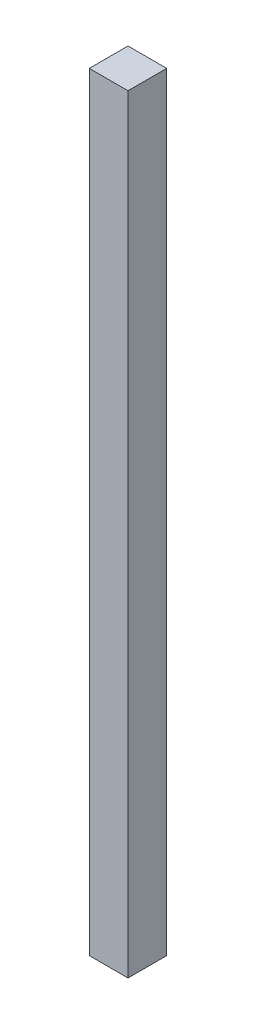
ISO-10303-21;
HEADER;
FILE_DESCRIPTION(('STEP AP214'),'2;1');
FILE_NAME('part.step','',(''),(''),'','','');
FILE_SCHEMA(('AUTOMOTIVE_DESIGN { 1 0 10303 214 1 1 1 1 }'));
ENDSEC;
DATA;
#1=APPLICATION_CONTEXT('core data for automotive mechanical design processes');
#2=APPLICATION_PROTOCOL_DEFINITION('international standard','automotive_design',2000,#1);
#3=PRODUCT_CONTEXT('',#1,'mechanical');
#4=PRODUCT('Part','Part','',(#3));
#5=PRODUCT_RELATED_PRODUCT_CATEGORY('part','',(#4));
#6=PRODUCT_DEFINITION_FORMATION('','',#4);
#7=PRODUCT_DEFINITION_CONTEXT('part definition',#1,'design');
#8=PRODUCT_DEFINITION('design','',#6,#7);
#9=PRODUCT_DEFINITION_SHAPE('','',#8);
#10=(LENGTH_UNIT() NAMED_UNIT(*) SI_UNIT(.MILLI.,.METRE.));
#11=(NAMED_UNIT(*) PLANE_ANGLE_UNIT() SI_UNIT($,.RADIAN.));
#12=(NAMED_UNIT(*) SI_UNIT($,.STERADIAN.) SOLID_ANGLE_UNIT());
#13=UNCERTAINTY_MEASURE_WITH_UNIT(LENGTH_MEASURE(1.E-05),#10,'distance_accuracy_value','');
#14=(GEOMETRIC_REPRESENTATION_CONTEXT(3) GLOBAL_UNCERTAINTY_ASSIGNED_CONTEXT((#13)) GLOBAL_UNIT_ASSIGNED_CONTEXT((#10,
#11,#12)) REPRESENTATION_CONTEXT('',''));
#15=CARTESIAN_POINT('',(0.,0.,0.));
#16=DIRECTION('',(0.,0.,1.));
#17=DIRECTION('',(1.,0.,0.));
#18=AXIS2_PLACEMENT_3D('',#15,#16,#17);
#19=CARTESIAN_POINT('',(-7.7715611723761E-13,503.682,2.66453525910038E-12));
#20=DIRECTION('',(1.,0.,0.));
#21=DIRECTION('',(0.,0.,-0.999999999999997));
#22=AXIS2_PLACEMENT_3D('',#19,#20,#21);
#23=PLANE('',#22);
#24=DIRECTION('',(0.,0.,0.999999999999997));
#25=VECTOR('',#24,1.);
#26=CARTESIAN_POINT('',(0.,0.,0.));
#27=LINE('',#26,#25);
#28=CARTESIAN_POINT('',(-5.55111512312578E-13,0.,-25.4000000000001));
#29=VERTEX_POINT('',#28);
#30=CARTESIAN_POINT('',(0.,0.,0.));
#31=VERTEX_POINT('',#30);
#32=EDGE_CURVE('E97',#29,#31,#27,.T.);
#33=ORIENTED_EDGE('',*,*,#32,.T.);
#34=DIRECTION('',(0.,-0.999999999999999,0.));
#35=VECTOR('',#34,1.);
#36=CARTESIAN_POINT('',(-7.7715611723761E-13,503.682,2.66453525910038E-12));
#37=LINE('',#36,#35);
#38=CARTESIAN_POINT('',(-7.7715611723761E-13,503.682,2.66453525910038E-12));
#39=VERTEX_POINT('',#38);
#40=EDGE_CURVE('E11',#39,#31,#37,.T.);
#41=ORIENTED_EDGE('',*,*,#40,.F.);
#42=DIRECTION('',(0.,0.,0.999999999999997));
#43=VECTOR('',#42,1.);
#44=CARTESIAN_POINT('',(-7.7715611723761E-13,503.682,2.66453525910038E-12));
#45=LINE('',#44,#43);
#46=CARTESIAN_POINT('',(-7.7715611723761E-13,503.682,-25.3999999999972));
#47=VERTEX_POINT('',#46);
#48=EDGE_CURVE('E85',#47,#39,#45,.T.);
#49=ORIENTED_EDGE('',*,*,#48,.F.);
#50=DIRECTION('',(0.,-0.999999999999999,0.));
#51=VECTOR('',#50,1.);
#52=CARTESIAN_POINT('',(-7.7715611723761E-13,503.682,-25.3999999999972));
#53=LINE('',#52,#51);
#54=EDGE_CURVE('E93',#47,#29,#53,.T.);
#55=ORIENTED_EDGE('',*,*,#54,.T.);
#56=EDGE_LOOP('',(#33,#41,#49,#55));
#57=FACE_BOUND('',#56,.T.);
#58=ADVANCED_FACE('F34',(#57),#23,.F.);
#59=CARTESIAN_POINT('',(-7.7715611723761E-13,503.682,2.66453525910038E-12));
#60=DIRECTION('',(0.,0.,-0.999999999999997));
#61=DIRECTION('',(-1.,0.,0.));
#62=AXIS2_PLACEMENT_3D('',#59,#60,#61);
#63=PLANE('',#62);
#64=DIRECTION('',(1.,0.,0.));
#65=VECTOR('',#64,1.);
#66=CARTESIAN_POINT('',(0.,0.,0.));
#67=LINE('',#66,#65);
#68=CARTESIAN_POINT('',(25.3999999999988,0.,0.));
#69=VERTEX_POINT('',#68);
#70=EDGE_CURVE('E89',#31,#69,#67,.T.);
#71=ORIENTED_EDGE('',*,*,#70,.T.);
#72=DIRECTION('',(0.,-0.999999999999999,0.));
#73=VECTOR('',#72,1.);
#74=CARTESIAN_POINT('',(25.3999999999994,503.682,2.66453525910038E-12));
#75=LINE('',#74,#73);
#76=CARTESIAN_POINT('',(25.3999999999994,503.682,2.66453525910038E-12));
#77=VERTEX_POINT('',#76);
#78=EDGE_CURVE('E42',#77,#69,#75,.T.);
#79=ORIENTED_EDGE('',*,*,#78,.F.);
#80=DIRECTION('',(1.,0.,0.));
#81=VECTOR('',#80,1.);
#82=CARTESIAN_POINT('',(-7.7715611723761E-13,503.682,2.66453525910038E-12));
#83=LINE('',#82,#81);
#84=EDGE_CURVE('E80',#39,#77,#83,.T.);
#85=ORIENTED_EDGE('',*,*,#84,.F.);
#86=ORIENTED_EDGE('',*,*,#40,.T.);
#87=EDGE_LOOP('',(#71,#79,#85,#86));
#88=FACE_BOUND('',#87,.T.);
#89=ADVANCED_FACE('F88',(#88),#63,.F.);
#90=CARTESIAN_POINT('',(25.3999999999994,503.682,2.66453525910038E-12));
#91=DIRECTION('',(-1.,0.,0.));
#92=DIRECTION('',(0.,0.,0.999999999999997));
#93=AXIS2_PLACEMENT_3D('',#90,#91,#92);
#94=PLANE('',#93);
#95=DIRECTION('',(0.,0.,-0.999999999999997));
#96=VECTOR('',#95,1.);
#97=CARTESIAN_POINT('',(25.3999999999988,0.,0.));
#98=LINE('',#97,#96);
#99=CARTESIAN_POINT('',(25.3999999999985,0.,-25.4000000000001));
#100=VERTEX_POINT('',#99);
#101=EDGE_CURVE('E67',#69,#100,#98,.T.);
#102=ORIENTED_EDGE('',*,*,#101,.T.);
#103=DIRECTION('',(0.,-0.999999999999999,0.));
#104=VECTOR('',#103,1.);
#105=CARTESIAN_POINT('',(25.3999999999994,503.682,-25.3999999999972));
#106=LINE('',#105,#104);
#107=CARTESIAN_POINT('',(25.3999999999994,503.682,-25.3999999999972));
#108=VERTEX_POINT('',#107);
#109=EDGE_CURVE('E90',#108,#100,#106,.T.);
#110=ORIENTED_EDGE('',*,*,#109,.F.);
#111=DIRECTION('',(0.,0.,-0.999999999999997));
#112=VECTOR('',#111,1.);
#113=CARTESIAN_POINT('',(25.3999999999994,503.682,2.66453525910038E-12));
#114=LINE('',#113,#112);
#115=EDGE_CURVE('E83',#77,#108,#114,.T.);
#116=ORIENTED_EDGE('',*,*,#115,.F.);
#117=ORIENTED_EDGE('',*,*,#78,.T.);
#118=EDGE_LOOP('',(#102,#110,#116,#117));
#119=FACE_BOUND('',#118,.T.);
#120=ADVANCED_FACE('F91',(#119),#94,.F.);
#121=CARTESIAN_POINT('',(-7.7715611723761E-13,503.682,-25.3999999999972));
#122=DIRECTION('',(0.,0.,0.999999999999997));
#123=DIRECTION('',(1.,0.,0.));
#124=AXIS2_PLACEMENT_3D('',#121,#122,#123);
#125=PLANE('',#124);
#126=DIRECTION('',(-1.,0.,0.));
#127=VECTOR('',#126,1.);
#128=CARTESIAN_POINT('',(-5.55111512312578E-13,0.,-25.4000000000001));
#129=LINE('',#128,#127);
#130=EDGE_CURVE('E73',#100,#29,#129,.T.);
#131=ORIENTED_EDGE('',*,*,#130,.T.);
#132=ORIENTED_EDGE('',*,*,#54,.F.);
#133=DIRECTION('',(-1.,0.,0.));
#134=VECTOR('',#133,1.);
#135=CARTESIAN_POINT('',(-7.7715611723761E-13,503.682,-25.3999999999972));
#136=LINE('',#135,#134);
#137=EDGE_CURVE('E50',#108,#47,#136,.T.);
#138=ORIENTED_EDGE('',*,*,#137,.F.);
#139=ORIENTED_EDGE('',*,*,#109,.T.);
#140=EDGE_LOOP('',(#131,#132,#138,#139));
#141=FACE_BOUND('',#140,.T.);
#142=ADVANCED_FACE('F104',(#141),#125,.F.);
#143=CARTESIAN_POINT('',(-7.7715611723761E-13,503.682,2.66453525910038E-12));
#144=DIRECTION('',(0.,-0.999999999999999,0.));
#145=DIRECTION('',(0.,0.,-0.999999999999997));
#146=AXIS2_PLACEMENT_3D('',#143,#144,#145);
#147=PLANE('',#146);
#148=ORIENTED_EDGE('',*,*,#48,.T.);
#149=ORIENTED_EDGE('',*,*,#84,.T.);
#150=ORIENTED_EDGE('',*,*,#115,.T.);
#151=ORIENTED_EDGE('',*,*,#137,.T.);
#152=EDGE_LOOP('',(#148,#149,#150,#151));
#153=FACE_BOUND('',#152,.T.);
#154=ADVANCED_FACE('F81',(#153),#147,.F.);
#155=CARTESIAN_POINT('',(0.,0.,0.));
#156=DIRECTION('',(0.,-0.999999999999999,0.));
#157=DIRECTION('',(0.,0.,-0.999999999999997));
#158=AXIS2_PLACEMENT_3D('',#155,#156,#157);
#159=PLANE('',#158);
#160=ORIENTED_EDGE('',*,*,#32,.F.);
#161=ORIENTED_EDGE('',*,*,#130,.F.);
#162=ORIENTED_EDGE('',*,*,#101,.F.);
#163=ORIENTED_EDGE('',*,*,#70,.F.);
#164=EDGE_LOOP('',(#160,#161,#162,#163));
#165=FACE_BOUND('',#164,.T.);
#166=ADVANCED_FACE('F107',(#165),#159,.T.);
#167=CLOSED_SHELL('',(#58,#89,#120,#142,#154,#166));
#168=MANIFOLD_SOLID_BREP('B2',#167);
#169=ADVANCED_BREP_SHAPE_REPRESENTATION('',(#18,#168),#14);
#170=SHAPE_DEFINITION_REPRESENTATION(#9,#169);
ENDSEC;
END-ISO-10303-21;
